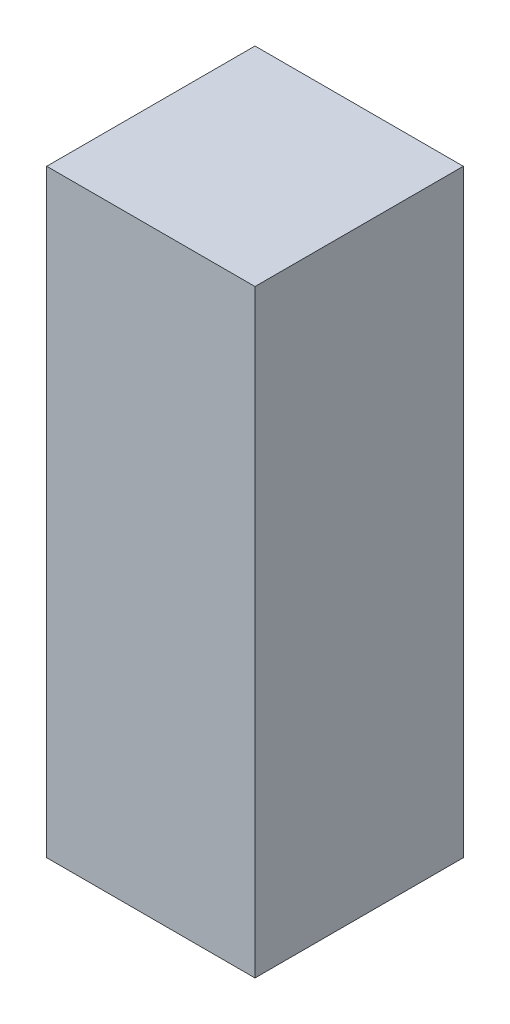
ISO-10303-21;
HEADER;
FILE_DESCRIPTION(('STEP AP214'),'2;1');
FILE_NAME('part.step','',(''),(''),'','','');
FILE_SCHEMA(('AUTOMOTIVE_DESIGN { 1 0 10303 214 1 1 1 1 }'));
ENDSEC;
DATA;
#1=APPLICATION_CONTEXT('core data for automotive mechanical design processes');
#2=APPLICATION_PROTOCOL_DEFINITION('international standard','automotive_design',2000,#1);
#3=PRODUCT_CONTEXT('',#1,'mechanical');
#4=PRODUCT('Part','Part','',(#3));
#5=PRODUCT_RELATED_PRODUCT_CATEGORY('part','',(#4));
#6=PRODUCT_DEFINITION_FORMATION('','',#4);
#7=PRODUCT_DEFINITION_CONTEXT('part definition',#1,'design');
#8=PRODUCT_DEFINITION('design','',#6,#7);
#9=PRODUCT_DEFINITION_SHAPE('','',#8);
#10=(LENGTH_UNIT() NAMED_UNIT(*) SI_UNIT(.MILLI.,.METRE.));
#11=(NAMED_UNIT(*) PLANE_ANGLE_UNIT() SI_UNIT($,.RADIAN.));
#12=(NAMED_UNIT(*) SI_UNIT($,.STERADIAN.) SOLID_ANGLE_UNIT());
#13=UNCERTAINTY_MEASURE_WITH_UNIT(LENGTH_MEASURE(1.E-05),#10,'distance_accuracy_value','');
#14=(GEOMETRIC_REPRESENTATION_CONTEXT(3) GLOBAL_UNCERTAINTY_ASSIGNED_CONTEXT((#13)) GLOBAL_UNIT_ASSIGNED_CONTEXT((#10,
#11,#12)) REPRESENTATION_CONTEXT('',''));
#15=CARTESIAN_POINT('',(0.,0.,0.));
#16=DIRECTION('',(0.,0.,1.));
#17=DIRECTION('',(1.,0.,0.));
#18=AXIS2_PLACEMENT_3D('',#15,#16,#17);
#19=CARTESIAN_POINT('',(40.,36.2919132149901,43.3234714003945));
#20=DIRECTION('',(0.,0.,-1.));
#21=DIRECTION('',(-1.,0.,0.));
#22=AXIS2_PLACEMENT_3D('',#19,#20,#21);
#23=PLANE('',#22);
#24=DIRECTION('',(0.,-1.,0.));
#25=VECTOR('',#24,1.);
#26=CARTESIAN_POINT('',(0.,36.2919132149901,43.3234714003945));
#27=LINE('',#26,#25);
#28=CARTESIAN_POINT('',(0.,36.2919132149901,43.3234714003945));
#29=VERTEX_POINT('',#28);
#30=CARTESIAN_POINT('',(0.,-78.7080867850099,43.3234714003945));
#31=VERTEX_POINT('',#30);
#32=EDGE_CURVE('E114',#29,#31,#27,.T.);
#33=ORIENTED_EDGE('',*,*,#32,.T.);
#34=DIRECTION('',(-1.,0.,0.));
#35=VECTOR('',#34,1.);
#36=CARTESIAN_POINT('',(40.,-78.7080867850099,43.3234714003945));
#37=LINE('',#36,#35);
#38=CARTESIAN_POINT('',(40.,-78.7080867850099,43.3234714003945));
#39=VERTEX_POINT('',#38);
#40=EDGE_CURVE('E11',#39,#31,#37,.T.);
#41=ORIENTED_EDGE('',*,*,#40,.F.);
#42=DIRECTION('',(0.,-1.,0.));
#43=VECTOR('',#42,1.);
#44=CARTESIAN_POINT('',(40.,36.2919132149901,43.3234714003945));
#45=LINE('',#44,#43);
#46=CARTESIAN_POINT('',(40.,36.2919132149901,43.3234714003945));
#47=VERTEX_POINT('',#46);
#48=EDGE_CURVE('E115',#47,#39,#45,.T.);
#49=ORIENTED_EDGE('',*,*,#48,.F.);
#50=DIRECTION('',(-1.,0.,0.));
#51=VECTOR('',#50,1.);
#52=CARTESIAN_POINT('',(40.,36.2919132149901,43.3234714003945));
#53=LINE('',#52,#51);
#54=EDGE_CURVE('E121',#47,#29,#53,.T.);
#55=ORIENTED_EDGE('',*,*,#54,.T.);
#56=EDGE_LOOP('',(#33,#41,#49,#55));
#57=FACE_BOUND('',#56,.T.);
#58=ADVANCED_FACE('F39',(#57),#23,.F.);
#59=CARTESIAN_POINT('',(40.,-78.7080867850099,43.3234714003945));
#60=DIRECTION('',(0.,1.,0.));
#61=DIRECTION('',(0.,0.,1.));
#62=AXIS2_PLACEMENT_3D('',#59,#60,#61);
#63=PLANE('',#62);
#64=DIRECTION('',(0.,0.,-1.));
#65=VECTOR('',#64,1.);
#66=CARTESIAN_POINT('',(0.,-78.7080867850099,43.3234714003945));
#67=LINE('',#66,#65);
#68=CARTESIAN_POINT('',(0.,-78.7080867850099,3.32347140039448));
#69=VERTEX_POINT('',#68);
#70=EDGE_CURVE('E124',#31,#69,#67,.T.);
#71=ORIENTED_EDGE('',*,*,#70,.T.);
#72=DIRECTION('',(-1.,0.,0.));
#73=VECTOR('',#72,1.);
#74=CARTESIAN_POINT('',(40.,-78.7080867850099,3.32347140039448));
#75=LINE('',#74,#73);
#76=CARTESIAN_POINT('',(40.,-78.7080867850099,3.32347140039448));
#77=VERTEX_POINT('',#76);
#78=EDGE_CURVE('E47',#77,#69,#75,.T.);
#79=ORIENTED_EDGE('',*,*,#78,.F.);
#80=DIRECTION('',(0.,0.,-1.));
#81=VECTOR('',#80,1.);
#82=CARTESIAN_POINT('',(40.,-78.7080867850099,43.3234714003945));
#83=LINE('',#82,#81);
#84=EDGE_CURVE('E86',#39,#77,#83,.T.);
#85=ORIENTED_EDGE('',*,*,#84,.F.);
#86=ORIENTED_EDGE('',*,*,#40,.T.);
#87=EDGE_LOOP('',(#71,#79,#85,#86));
#88=FACE_BOUND('',#87,.T.);
#89=ADVANCED_FACE('F148',(#88),#63,.F.);
#90=CARTESIAN_POINT('',(40.,36.2919132149901,3.32347140039449));
#91=DIRECTION('',(0.,0.,1.));
#92=DIRECTION('',(0.,-1.,0.));
#93=AXIS2_PLACEMENT_3D('',#90,#91,#92);
#94=PLANE('',#93);
#95=CARTESIAN_POINT('',(20.,-43.7080867850099,3.32347140039449));
#96=DIRECTION('',(0.,0.,-1.));
#97=DIRECTION('',(0.,1.,0.));
#98=AXIS2_PLACEMENT_3D('',#95,#96,#97);
#99=CIRCLE('',#98,3.3);
#100=CARTESIAN_POINT('',(20.,-40.4080867850099,3.32347140039449));
#101=VERTEX_POINT('',#100);
#102=EDGE_CURVE('E104',#101,#101,#99,.T.);
#103=ORIENTED_EDGE('',*,*,#102,.F.);
#104=EDGE_LOOP('',(#103));
#105=FACE_BOUND('',#104,.T.);
#106=CARTESIAN_POINT('',(20.,-24.7080867850099,3.32347140039449));
#107=DIRECTION('',(0.,0.,-1.));
#108=DIRECTION('',(0.,1.,0.));
#109=AXIS2_PLACEMENT_3D('',#106,#107,#108);
#110=CIRCLE('',#109,1.69999999999999);
#111=CARTESIAN_POINT('',(20.,-23.0080867850099,3.32347140039449));
#112=VERTEX_POINT('',#111);
#113=EDGE_CURVE('E103',#112,#112,#110,.T.);
#114=ORIENTED_EDGE('',*,*,#113,.F.);
#115=EDGE_LOOP('',(#114));
#116=FACE_BOUND('',#115,.T.);
#117=DIRECTION('',(0.,1.,0.));
#118=VECTOR('',#117,1.);
#119=CARTESIAN_POINT('',(0.,36.2919132149901,3.32347140039449));
#120=LINE('',#119,#118);
#121=CARTESIAN_POINT('',(0.,36.2919132149901,3.32347140039449));
#122=VERTEX_POINT('',#121);
#123=EDGE_CURVE('E73',#69,#122,#120,.T.);
#124=ORIENTED_EDGE('',*,*,#123,.T.);
#125=DIRECTION('',(-1.,0.,0.));
#126=VECTOR('',#125,1.);
#127=CARTESIAN_POINT('',(40.,36.2919132149901,3.32347140039449));
#128=LINE('',#127,#126);
#129=CARTESIAN_POINT('',(40.,36.2919132149901,3.32347140039449));
#130=VERTEX_POINT('',#129);
#131=EDGE_CURVE('E129',#130,#122,#128,.T.);
#132=ORIENTED_EDGE('',*,*,#131,.F.);
#133=DIRECTION('',(0.,1.,0.));
#134=VECTOR('',#133,1.);
#135=CARTESIAN_POINT('',(40.,36.2919132149901,3.32347140039449));
#136=LINE('',#135,#134);
#137=EDGE_CURVE('E118',#77,#130,#136,.T.);
#138=ORIENTED_EDGE('',*,*,#137,.F.);
#139=ORIENTED_EDGE('',*,*,#78,.T.);
#140=EDGE_LOOP('',(#124,#132,#138,#139));
#141=FACE_BOUND('',#140,.T.);
#142=ADVANCED_FACE('F131',(#105,#116,#141),#94,.F.);
#143=CARTESIAN_POINT('',(40.,36.2919132149901,43.3234714003945));
#144=DIRECTION('',(0.,-1.,0.));
#145=DIRECTION('',(0.,0.,-1.));
#146=AXIS2_PLACEMENT_3D('',#143,#144,#145);
#147=PLANE('',#146);
#148=DIRECTION('',(0.,0.,1.));
#149=VECTOR('',#148,1.);
#150=CARTESIAN_POINT('',(0.,36.2919132149901,43.3234714003945));
#151=LINE('',#150,#149);
#152=EDGE_CURVE('E79',#122,#29,#151,.T.);
#153=ORIENTED_EDGE('',*,*,#152,.T.);
#154=ORIENTED_EDGE('',*,*,#54,.F.);
#155=DIRECTION('',(0.,0.,1.));
#156=VECTOR('',#155,1.);
#157=CARTESIAN_POINT('',(40.,36.2919132149901,43.3234714003945));
#158=LINE('',#157,#156);
#159=EDGE_CURVE('E55',#130,#47,#158,.T.);
#160=ORIENTED_EDGE('',*,*,#159,.F.);
#161=ORIENTED_EDGE('',*,*,#131,.T.);
#162=EDGE_LOOP('',(#153,#154,#160,#161));
#163=FACE_BOUND('',#162,.T.);
#164=ADVANCED_FACE('F138',(#163),#147,.F.);
#165=CARTESIAN_POINT('',(40.,0.,0.));
#166=DIRECTION('',(1.,0.,0.));
#167=DIRECTION('',(0.,0.,-1.));
#168=AXIS2_PLACEMENT_3D('',#165,#166,#167);
#169=PLANE('',#168);
#170=ORIENTED_EDGE('',*,*,#48,.T.);
#171=ORIENTED_EDGE('',*,*,#84,.T.);
#172=ORIENTED_EDGE('',*,*,#137,.T.);
#173=ORIENTED_EDGE('',*,*,#159,.T.);
#174=EDGE_LOOP('',(#170,#171,#172,#173));
#175=FACE_BOUND('',#174,.T.);
#176=ADVANCED_FACE('F140',(#175),#169,.T.);
#177=CARTESIAN_POINT('',(0.,0.,0.));
#178=DIRECTION('',(1.,0.,0.));
#179=DIRECTION('',(0.,0.,-1.));
#180=AXIS2_PLACEMENT_3D('',#177,#178,#179);
#181=PLANE('',#180);
#182=ORIENTED_EDGE('',*,*,#32,.F.);
#183=ORIENTED_EDGE('',*,*,#152,.F.);
#184=ORIENTED_EDGE('',*,*,#123,.F.);
#185=ORIENTED_EDGE('',*,*,#70,.F.);
#186=EDGE_LOOP('',(#182,#183,#184,#185));
#187=FACE_BOUND('',#186,.T.);
#188=ADVANCED_FACE('F134',(#187),#181,.F.);
#189=CARTESIAN_POINT('',(20.,-24.7080867850099,8.32347140039449));
#190=DIRECTION('',(0.,0.,-1.));
#191=DIRECTION('',(0.,1.,0.));
#192=AXIS2_PLACEMENT_3D('',#189,#190,#191);
#193=CONICAL_SURFACE('',#192,1.69999999999999,1.02974425867665);
#194=CARTESIAN_POINT('',(20.,-24.7080867850099,9.34493445274134));
#195=VERTEX_POINT('',#194);
#196=VERTEX_LOOP('',#195);
#197=FACE_BOUND('',#196,.T.);
#198=CARTESIAN_POINT('',(20.,-24.7080867850099,8.32347140039449));
#199=DIRECTION('',(0.,0.,-1.));
#200=DIRECTION('',(0.,1.,0.));
#201=AXIS2_PLACEMENT_3D('',#198,#199,#200);
#202=CIRCLE('',#201,1.69999999999999);
#203=CARTESIAN_POINT('',(20.,-23.0080867850099,8.32347140039449));
#204=VERTEX_POINT('',#203);
#205=EDGE_CURVE('E107',#204,#204,#202,.T.);
#206=ORIENTED_EDGE('',*,*,#205,.T.);
#207=EDGE_LOOP('',(#206));
#208=FACE_BOUND('',#207,.T.);
#209=ADVANCED_FACE('F187',(#197,#208),#193,.F.);
#210=CARTESIAN_POINT('',(20.,-24.7080867850099,3.32347140039449));
#211=DIRECTION('',(0.,0.,-1.));
#212=DIRECTION('',(0.,1.,0.));
#213=AXIS2_PLACEMENT_3D('',#210,#211,#212);
#214=CYLINDRICAL_SURFACE('',#213,1.69999999999999);
#215=ORIENTED_EDGE('',*,*,#205,.F.);
#216=EDGE_LOOP('',(#215));
#217=FACE_BOUND('',#216,.T.);
#218=ORIENTED_EDGE('',*,*,#113,.T.);
#219=EDGE_LOOP('',(#218));
#220=FACE_BOUND('',#219,.T.);
#221=ADVANCED_FACE('F97',(#217,#220),#214,.F.);
#222=CARTESIAN_POINT('',(20.,-43.7080867850099,8.32347140039449));
#223=DIRECTION('',(0.,0.,-1.));
#224=DIRECTION('',(0.,1.,0.));
#225=AXIS2_PLACEMENT_3D('',#222,#223,#224);
#226=CONICAL_SURFACE('',#225,3.3,1.02974425867665);
#227=CARTESIAN_POINT('',(20.,-43.7080867850099,10.3063114431854));
#228=VERTEX_POINT('',#227);
#229=VERTEX_LOOP('',#228);
#230=FACE_BOUND('',#229,.T.);
#231=CARTESIAN_POINT('',(20.,-43.7080867850099,8.32347140039449));
#232=DIRECTION('',(0.,0.,-1.));
#233=DIRECTION('',(0.,1.,0.));
#234=AXIS2_PLACEMENT_3D('',#231,#232,#233);
#235=CIRCLE('',#234,3.3);
#236=CARTESIAN_POINT('',(20.,-40.4080867850099,8.32347140039449));
#237=VERTEX_POINT('',#236);
#238=EDGE_CURVE('E101',#237,#237,#235,.T.);
#239=ORIENTED_EDGE('',*,*,#238,.T.);
#240=EDGE_LOOP('',(#239));
#241=FACE_BOUND('',#240,.T.);
#242=ADVANCED_FACE('F93',(#230,#241),#226,.F.);
#243=CARTESIAN_POINT('',(20.,-43.7080867850099,3.32347140039449));
#244=DIRECTION('',(0.,0.,-1.));
#245=DIRECTION('',(0.,1.,0.));
#246=AXIS2_PLACEMENT_3D('',#243,#244,#245);
#247=CYLINDRICAL_SURFACE('',#246,3.3);
#248=ORIENTED_EDGE('',*,*,#238,.F.);
#249=EDGE_LOOP('',(#248));
#250=FACE_BOUND('',#249,.T.);
#251=ORIENTED_EDGE('',*,*,#102,.T.);
#252=EDGE_LOOP('',(#251));
#253=FACE_BOUND('',#252,.T.);
#254=ADVANCED_FACE('F96',(#250,#253),#247,.F.);
#255=CLOSED_SHELL('',(#58,#89,#142,#164,#176,#188,#209,#221,#242,#254));
#256=MANIFOLD_SOLID_BREP('B2',#255);
#257=ADVANCED_BREP_SHAPE_REPRESENTATION('',(#18,#256),#14);
#258=SHAPE_DEFINITION_REPRESENTATION(#9,#257);
ENDSEC;
END-ISO-10303-21;
